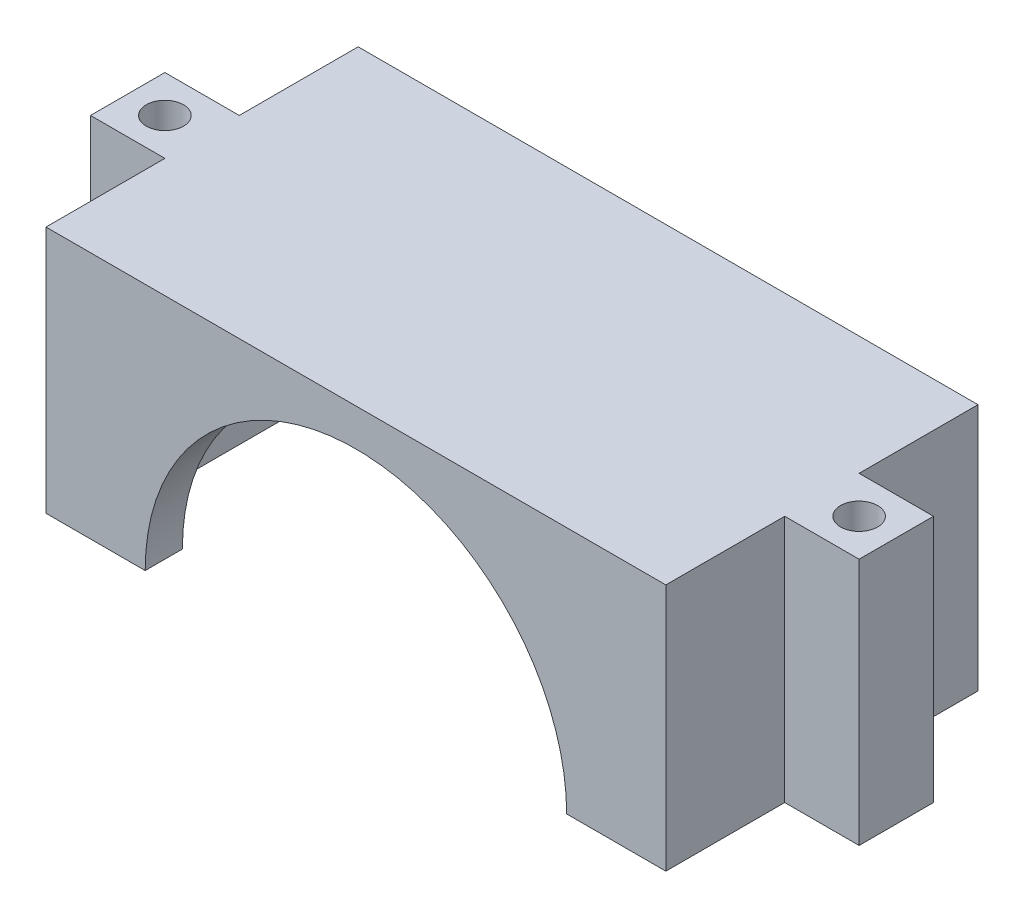
ISO-10303-21;
HEADER;
FILE_DESCRIPTION(('STEP AP214'),'2;1');
FILE_NAME('part.step','',(''),(''),'','','');
FILE_SCHEMA(('AUTOMOTIVE_DESIGN { 1 0 10303 214 1 1 1 1 }'));
ENDSEC;
DATA;
#1=APPLICATION_CONTEXT('core data for automotive mechanical design processes');
#2=APPLICATION_PROTOCOL_DEFINITION('international standard','automotive_design',2000,#1);
#3=PRODUCT_CONTEXT('',#1,'mechanical');
#4=PRODUCT('Part','Part','',(#3));
#5=PRODUCT_RELATED_PRODUCT_CATEGORY('part','',(#4));
#6=PRODUCT_DEFINITION_FORMATION('','',#4);
#7=PRODUCT_DEFINITION_CONTEXT('part definition',#1,'design');
#8=PRODUCT_DEFINITION('design','',#6,#7);
#9=PRODUCT_DEFINITION_SHAPE('','',#8);
#10=(LENGTH_UNIT() NAMED_UNIT(*) SI_UNIT(.MILLI.,.METRE.));
#11=(NAMED_UNIT(*) PLANE_ANGLE_UNIT() SI_UNIT($,.RADIAN.));
#12=(NAMED_UNIT(*) SI_UNIT($,.STERADIAN.) SOLID_ANGLE_UNIT());
#13=UNCERTAINTY_MEASURE_WITH_UNIT(LENGTH_MEASURE(1.E-05),#10,'distance_accuracy_value','');
#14=(GEOMETRIC_REPRESENTATION_CONTEXT(3) GLOBAL_UNCERTAINTY_ASSIGNED_CONTEXT((#13)) GLOBAL_UNIT_ASSIGNED_CONTEXT((#10,
#11,#12)) REPRESENTATION_CONTEXT('',''));
#15=CARTESIAN_POINT('',(0.,0.,0.));
#16=DIRECTION('',(0.,0.,1.));
#17=DIRECTION('',(1.,0.,0.));
#18=AXIS2_PLACEMENT_3D('',#15,#16,#17);
#19=CARTESIAN_POINT('',(-25.,20.,12.59));
#20=DIRECTION('',(1.,0.,0.));
#21=DIRECTION('',(0.,0.,-1.));
#22=AXIS2_PLACEMENT_3D('',#19,#20,#21);
#23=PLANE('',#22);
#24=DIRECTION('',(0.,1.,0.));
#25=VECTOR('',#24,1.);
#26=CARTESIAN_POINT('',(-25.,0.,3.00000000000001));
#27=LINE('',#26,#25);
#28=CARTESIAN_POINT('',(-25.,0.,3.00000000000001));
#29=VERTEX_POINT('',#28);
#30=CARTESIAN_POINT('',(-25.,20.,3.00000000000001));
#31=VERTEX_POINT('',#30);
#32=EDGE_CURVE('E185',#29,#31,#27,.T.);
#33=ORIENTED_EDGE('',*,*,#32,.F.);
#34=DIRECTION('',(0.,0.,1.));
#35=VECTOR('',#34,1.);
#36=CARTESIAN_POINT('',(-25.,0.,12.59));
#37=LINE('',#36,#35);
#38=CARTESIAN_POINT('',(-25.,0.,12.59));
#39=VERTEX_POINT('',#38);
#40=EDGE_CURVE('E198',#29,#39,#37,.T.);
#41=ORIENTED_EDGE('',*,*,#40,.T.);
#42=DIRECTION('',(0.,-1.,0.));
#43=VECTOR('',#42,1.);
#44=CARTESIAN_POINT('',(-25.,20.,12.59));
#45=LINE('',#44,#43);
#46=CARTESIAN_POINT('',(-25.,20.,12.59));
#47=VERTEX_POINT('',#46);
#48=EDGE_CURVE('E235',#47,#39,#45,.T.);
#49=ORIENTED_EDGE('',*,*,#48,.F.);
#50=DIRECTION('',(0.,0.,1.));
#51=VECTOR('',#50,1.);
#52=CARTESIAN_POINT('',(-25.,20.,12.59));
#53=LINE('',#52,#51);
#54=EDGE_CURVE('E200',#31,#47,#53,.T.);
#55=ORIENTED_EDGE('',*,*,#54,.F.);
#56=EDGE_LOOP('',(#33,#41,#49,#55));
#57=FACE_BOUND('',#56,.T.);
#58=ADVANCED_FACE('F35',(#57),#23,.F.);
#59=CARTESIAN_POINT('',(25.,20.,12.59));
#60=DIRECTION('',(-1.,0.,0.));
#61=DIRECTION('',(0.,0.,1.));
#62=AXIS2_PLACEMENT_3D('',#59,#60,#61);
#63=PLANE('',#62);
#64=DIRECTION('',(0.,1.,0.));
#65=VECTOR('',#64,1.);
#66=CARTESIAN_POINT('',(25.,0.,-3.));
#67=LINE('',#66,#65);
#68=CARTESIAN_POINT('',(25.,0.,-3.));
#69=VERTEX_POINT('',#68);
#70=CARTESIAN_POINT('',(25.,20.,-3.));
#71=VERTEX_POINT('',#70);
#72=EDGE_CURVE('E419',#69,#71,#67,.T.);
#73=ORIENTED_EDGE('',*,*,#72,.F.);
#74=DIRECTION('',(0.,0.,-1.));
#75=VECTOR('',#74,1.);
#76=CARTESIAN_POINT('',(25.,0.,12.59));
#77=LINE('',#76,#75);
#78=CARTESIAN_POINT('',(25.,0.,-12.59));
#79=VERTEX_POINT('',#78);
#80=EDGE_CURVE('E248',#69,#79,#77,.T.);
#81=ORIENTED_EDGE('',*,*,#80,.T.);
#82=DIRECTION('',(0.,-1.,0.));
#83=VECTOR('',#82,1.);
#84=CARTESIAN_POINT('',(25.,20.,-12.59));
#85=LINE('',#84,#83);
#86=CARTESIAN_POINT('',(25.,20.,-12.59));
#87=VERTEX_POINT('',#86);
#88=EDGE_CURVE('E241',#87,#79,#85,.T.);
#89=ORIENTED_EDGE('',*,*,#88,.F.);
#90=DIRECTION('',(0.,0.,-1.));
#91=VECTOR('',#90,1.);
#92=CARTESIAN_POINT('',(25.,20.,12.59));
#93=LINE('',#92,#91);
#94=EDGE_CURVE('E231',#71,#87,#93,.T.);
#95=ORIENTED_EDGE('',*,*,#94,.F.);
#96=EDGE_LOOP('',(#73,#81,#89,#95));
#97=FACE_BOUND('',#96,.T.);
#98=ADVANCED_FACE('F314',(#97),#63,.F.);
#99=CARTESIAN_POINT('',(-25.,20.,-12.59));
#100=DIRECTION('',(0.,0.,1.));
#101=DIRECTION('',(1.,0.,0.));
#102=AXIS2_PLACEMENT_3D('',#99,#100,#101);
#103=PLANE('',#102);
#104=DIRECTION('',(0.,-1.,0.));
#105=VECTOR('',#104,1.);
#106=CARTESIAN_POINT('',(12.,0.,-12.59));
#107=LINE('',#106,#105);
#108=CARTESIAN_POINT('',(12.,6.,-12.59));
#109=VERTEX_POINT('',#108);
#110=CARTESIAN_POINT('',(12.,0.,-12.59));
#111=VERTEX_POINT('',#110);
#112=EDGE_CURVE('E344',#109,#111,#107,.T.);
#113=ORIENTED_EDGE('',*,*,#112,.T.);
#114=DIRECTION('',(-1.,0.,0.));
#115=VECTOR('',#114,1.);
#116=CARTESIAN_POINT('',(-25.,0.,-12.59));
#117=LINE('',#116,#115);
#118=CARTESIAN_POINT('',(-25.,0.,-12.59));
#119=VERTEX_POINT('',#118);
#120=EDGE_CURVE('E218',#111,#119,#117,.T.);
#121=ORIENTED_EDGE('',*,*,#120,.T.);
#122=DIRECTION('',(0.,-1.,0.));
#123=VECTOR('',#122,1.);
#124=CARTESIAN_POINT('',(-25.,20.,-12.59));
#125=LINE('',#124,#123);
#126=CARTESIAN_POINT('',(-25.,20.,-12.59));
#127=VERTEX_POINT('',#126);
#128=EDGE_CURVE('E238',#127,#119,#125,.T.);
#129=ORIENTED_EDGE('',*,*,#128,.F.);
#130=DIRECTION('',(-1.,0.,0.));
#131=VECTOR('',#130,1.);
#132=CARTESIAN_POINT('',(-25.,20.,-12.59));
#133=LINE('',#132,#131);
#134=EDGE_CURVE('E255',#87,#127,#133,.T.);
#135=ORIENTED_EDGE('',*,*,#134,.F.);
#136=ORIENTED_EDGE('',*,*,#88,.T.);
#137=CARTESIAN_POINT('',(22.,0.,-12.59));
#138=VERTEX_POINT('',#137);
#139=EDGE_CURVE('E212',#79,#138,#117,.T.);
#140=ORIENTED_EDGE('',*,*,#139,.T.);
#141=DIRECTION('',(0.,-1.,0.));
#142=VECTOR('',#141,1.);
#143=CARTESIAN_POINT('',(22.,0.,-12.59));
#144=LINE('',#143,#142);
#145=CARTESIAN_POINT('',(22.,6.,-12.59));
#146=VERTEX_POINT('',#145);
#147=EDGE_CURVE('E351',#146,#138,#144,.T.);
#148=ORIENTED_EDGE('',*,*,#147,.F.);
#149=DIRECTION('',(-1.,0.,0.));
#150=VECTOR('',#149,1.);
#151=CARTESIAN_POINT('',(0.,6.,-12.59));
#152=LINE('',#151,#150);
#153=EDGE_CURVE('E347',#146,#109,#152,.T.);
#154=ORIENTED_EDGE('',*,*,#153,.T.);
#155=EDGE_LOOP('',(#113,#121,#129,#135,#136,#140,#148,#154));
#156=FACE_BOUND('',#155,.T.);
#157=ADVANCED_FACE('F320',(#156),#103,.F.);
#158=CARTESIAN_POINT('',(0.,0.,0.));
#159=DIRECTION('',(0.,-1.,0.));
#160=DIRECTION('',(0.,0.,-1.));
#161=AXIS2_PLACEMENT_3D('',#158,#159,#160);
#162=PLANE('',#161);
#163=ORIENTED_EDGE('',*,*,#120,.F.);
#164=DIRECTION('',(0.,0.,-1.));
#165=VECTOR('',#164,1.);
#166=CARTESIAN_POINT('',(12.,0.,4.41));
#167=LINE('',#166,#165);
#168=CARTESIAN_POINT('',(12.,0.,-9.59));
#169=VERTEX_POINT('',#168);
#170=EDGE_CURVE('E337',#169,#111,#167,.T.);
#171=ORIENTED_EDGE('',*,*,#170,.F.);
#172=DIRECTION('',(1.,0.,0.));
#173=VECTOR('',#172,1.);
#174=CARTESIAN_POINT('',(-22.,0.,-9.59));
#175=LINE('',#174,#173);
#176=CARTESIAN_POINT('',(-22.,0.,-9.59));
#177=VERTEX_POINT('',#176);
#178=EDGE_CURVE('E375',#177,#169,#175,.T.);
#179=ORIENTED_EDGE('',*,*,#178,.F.);
#180=DIRECTION('',(0.,0.,-1.));
#181=VECTOR('',#180,1.);
#182=CARTESIAN_POINT('',(-22.,0.,-9.59));
#183=LINE('',#182,#181);
#184=CARTESIAN_POINT('',(-22.,0.,9.59));
#185=VERTEX_POINT('',#184);
#186=EDGE_CURVE('E391',#185,#177,#183,.T.);
#187=ORIENTED_EDGE('',*,*,#186,.F.);
#188=DIRECTION('',(-1.,0.,0.));
#189=VECTOR('',#188,1.);
#190=CARTESIAN_POINT('',(-22.,0.,9.59));
#191=LINE('',#190,#189);
#192=CARTESIAN_POINT('',(-17.,0.,9.59));
#193=VERTEX_POINT('',#192);
#194=EDGE_CURVE('E387',#193,#185,#191,.T.);
#195=ORIENTED_EDGE('',*,*,#194,.F.);
#196=DIRECTION('',(0.,0.,1.));
#197=VECTOR('',#196,1.);
#198=CARTESIAN_POINT('',(-17.,0.,-28.4231556174964));
#199=LINE('',#198,#197);
#200=CARTESIAN_POINT('',(-17.,0.,12.59));
#201=VERTEX_POINT('',#200);
#202=EDGE_CURVE('E367',#193,#201,#199,.T.);
#203=ORIENTED_EDGE('',*,*,#202,.T.);
#204=DIRECTION('',(1.,0.,0.));
#205=VECTOR('',#204,1.);
#206=CARTESIAN_POINT('',(-25.,0.,12.59));
#207=LINE('',#206,#205);
#208=EDGE_CURVE('E210',#39,#201,#207,.T.);
#209=ORIENTED_EDGE('',*,*,#208,.F.);
#210=ORIENTED_EDGE('',*,*,#40,.F.);
#211=DIRECTION('',(1.,0.,0.));
#212=VECTOR('',#211,1.);
#213=CARTESIAN_POINT('',(-25.,0.,3.00000000000001));
#214=LINE('',#213,#212);
#215=CARTESIAN_POINT('',(-31.,0.,3.00000000000001));
#216=VERTEX_POINT('',#215);
#217=EDGE_CURVE('E181',#216,#29,#214,.T.);
#218=ORIENTED_EDGE('',*,*,#217,.F.);
#219=DIRECTION('',(0.,0.,1.));
#220=VECTOR('',#219,1.);
#221=CARTESIAN_POINT('',(-31.,0.,3.00000000000001));
#222=LINE('',#221,#220);
#223=CARTESIAN_POINT('',(-31.,0.,-2.99999999999999));
#224=VERTEX_POINT('',#223);
#225=EDGE_CURVE('E202',#224,#216,#222,.T.);
#226=ORIENTED_EDGE('',*,*,#225,.F.);
#227=DIRECTION('',(-1.,0.,0.));
#228=VECTOR('',#227,1.);
#229=CARTESIAN_POINT('',(-25.,0.,-2.99999999999999));
#230=LINE('',#229,#228);
#231=CARTESIAN_POINT('',(-25.,0.,-2.99999999999999));
#232=VERTEX_POINT('',#231);
#233=EDGE_CURVE('E192',#232,#224,#230,.T.);
#234=ORIENTED_EDGE('',*,*,#233,.F.);
#235=EDGE_CURVE('E211',#119,#232,#37,.T.);
#236=ORIENTED_EDGE('',*,*,#235,.F.);
#237=EDGE_LOOP('',(#163,#171,#179,#187,#195,#203,#209,#210,#218,#226,#234,#236));
#238=FACE_BOUND('',#237,.T.);
#239=CARTESIAN_POINT('',(-28.,0.,0.));
#240=DIRECTION('',(0.,1.,0.));
#241=DIRECTION('',(0.,0.,-1.));
#242=AXIS2_PLACEMENT_3D('',#239,#240,#241);
#243=CIRCLE('',#242,1.5);
#244=CARTESIAN_POINT('',(-28.,0.,-1.5));
#245=VERTEX_POINT('',#244);
#246=EDGE_CURVE('E278',#245,#245,#243,.T.);
#247=ORIENTED_EDGE('',*,*,#246,.T.);
#248=EDGE_LOOP('',(#247));
#249=FACE_BOUND('',#248,.T.);
#250=ADVANCED_FACE('F206',(#238,#249),#162,.T.);
#251=CARTESIAN_POINT('',(-22.,17.,-9.59));
#252=DIRECTION('',(0.,0.,-1.));
#253=DIRECTION('',(-1.,0.,0.));
#254=AXIS2_PLACEMENT_3D('',#251,#252,#253);
#255=PLANE('',#254);
#256=DIRECTION('',(-1.,0.,0.));
#257=VECTOR('',#256,1.);
#258=CARTESIAN_POINT('',(-22.,6.,-9.59));
#259=LINE('',#258,#257);
#260=CARTESIAN_POINT('',(22.,6.,-9.59));
#261=VERTEX_POINT('',#260);
#262=CARTESIAN_POINT('',(12.,6.,-9.59));
#263=VERTEX_POINT('',#262);
#264=EDGE_CURVE('E11',#261,#263,#259,.T.);
#265=ORIENTED_EDGE('',*,*,#264,.F.);
#266=DIRECTION('',(0.,-1.,0.));
#267=VECTOR('',#266,1.);
#268=CARTESIAN_POINT('',(22.,17.,-9.59));
#269=LINE('',#268,#267);
#270=CARTESIAN_POINT('',(22.,17.,-9.59));
#271=VERTEX_POINT('',#270);
#272=EDGE_CURVE('E395',#271,#261,#269,.T.);
#273=ORIENTED_EDGE('',*,*,#272,.F.);
#274=DIRECTION('',(1.,0.,0.));
#275=VECTOR('',#274,1.);
#276=CARTESIAN_POINT('',(-22.,17.,-9.59));
#277=LINE('',#276,#275);
#278=CARTESIAN_POINT('',(-22.,17.,-9.59));
#279=VERTEX_POINT('',#278);
#280=EDGE_CURVE('E382',#279,#271,#277,.T.);
#281=ORIENTED_EDGE('',*,*,#280,.F.);
#282=DIRECTION('',(0.,-1.,0.));
#283=VECTOR('',#282,1.);
#284=CARTESIAN_POINT('',(-22.,17.,-9.59));
#285=LINE('',#284,#283);
#286=EDGE_CURVE('E398',#279,#177,#285,.T.);
#287=ORIENTED_EDGE('',*,*,#286,.T.);
#288=ORIENTED_EDGE('',*,*,#178,.T.);
#289=DIRECTION('',(0.,-1.,0.));
#290=VECTOR('',#289,1.);
#291=CARTESIAN_POINT('',(12.,17.,-9.59));
#292=LINE('',#291,#290);
#293=EDGE_CURVE('E44',#263,#169,#292,.T.);
#294=ORIENTED_EDGE('',*,*,#293,.F.);
#295=EDGE_LOOP('',(#265,#273,#281,#287,#288,#294));
#296=FACE_BOUND('',#295,.T.);
#297=ADVANCED_FACE('F565',(#296),#255,.F.);
#298=CARTESIAN_POINT('',(-22.,17.,9.59));
#299=DIRECTION('',(0.,0.,1.));
#300=DIRECTION('',(1.,0.,0.));
#301=AXIS2_PLACEMENT_3D('',#298,#299,#300);
#302=PLANE('',#301);
#303=CARTESIAN_POINT('',(22.,0.,9.59));
#304=VERTEX_POINT('',#303);
#305=CARTESIAN_POINT('',(17.,0.,9.58999999999998));
#306=VERTEX_POINT('',#305);
#307=EDGE_CURVE('E388',#304,#306,#191,.T.);
#308=ORIENTED_EDGE('',*,*,#307,.T.);
#309=CARTESIAN_POINT('',(0.,0.,9.59));
#310=DIRECTION('',(0.,0.,1.));
#311=DIRECTION('',(1.,0.,0.));
#312=AXIS2_PLACEMENT_3D('',#309,#310,#311);
#313=CIRCLE('',#312,17.);
#314=CARTESIAN_POINT('',(0.,17.,9.59));
#315=VERTEX_POINT('',#314);
#316=EDGE_CURVE('E365',#315,#306,#313,.F.);
#317=ORIENTED_EDGE('',*,*,#316,.F.);
#318=DIRECTION('',(-1.,0.,0.));
#319=VECTOR('',#318,1.);
#320=CARTESIAN_POINT('',(-22.,17.,9.59));
#321=LINE('',#320,#319);
#322=CARTESIAN_POINT('',(22.,17.,9.59));
#323=VERTEX_POINT('',#322);
#324=EDGE_CURVE('E376',#323,#315,#321,.T.);
#325=ORIENTED_EDGE('',*,*,#324,.F.);
#326=DIRECTION('',(0.,-1.,0.));
#327=VECTOR('',#326,1.);
#328=CARTESIAN_POINT('',(22.,17.,9.59));
#329=LINE('',#328,#327);
#330=EDGE_CURVE('E385',#323,#304,#329,.T.);
#331=ORIENTED_EDGE('',*,*,#330,.T.);
#332=EDGE_LOOP('',(#308,#317,#325,#331));
#333=FACE_BOUND('',#332,.T.);
#334=ADVANCED_FACE('F331',(#333),#302,.F.);
#335=CARTESIAN_POINT('',(25.,0.,12.59));
#336=VERTEX_POINT('',#335);
#337=CARTESIAN_POINT('',(25.,0.,3.));
#338=VERTEX_POINT('',#337);
#339=EDGE_CURVE('E245',#336,#338,#77,.T.);
#340=ORIENTED_EDGE('',*,*,#339,.T.);
#341=DIRECTION('',(0.,1.,0.));
#342=VECTOR('',#341,1.);
#343=CARTESIAN_POINT('',(25.,0.,3.));
#344=LINE('',#343,#342);
#345=CARTESIAN_POINT('',(25.,20.,3.));
#346=VERTEX_POINT('',#345);
#347=EDGE_CURVE('E439',#338,#346,#344,.T.);
#348=ORIENTED_EDGE('',*,*,#347,.T.);
#349=CARTESIAN_POINT('',(25.,20.,12.59));
#350=VERTEX_POINT('',#349);
#351=EDGE_CURVE('E408',#350,#346,#93,.T.);
#352=ORIENTED_EDGE('',*,*,#351,.F.);
#353=DIRECTION('',(0.,-1.,0.));
#354=VECTOR('',#353,1.);
#355=CARTESIAN_POINT('',(25.,20.,12.59));
#356=LINE('',#355,#354);
#357=EDGE_CURVE('E232',#350,#336,#356,.T.);
#358=ORIENTED_EDGE('',*,*,#357,.T.);
#359=EDGE_LOOP('',(#340,#348,#352,#358));
#360=FACE_BOUND('',#359,.T.);
#361=ADVANCED_FACE('F37',(#360),#63,.F.);
#362=ORIENTED_EDGE('',*,*,#235,.T.);
#363=DIRECTION('',(0.,1.,0.));
#364=VECTOR('',#363,1.);
#365=CARTESIAN_POINT('',(-25.,0.,-2.99999999999999));
#366=LINE('',#365,#364);
#367=CARTESIAN_POINT('',(-25.,20.,-2.99999999999999));
#368=VERTEX_POINT('',#367);
#369=EDGE_CURVE('E201',#232,#368,#366,.T.);
#370=ORIENTED_EDGE('',*,*,#369,.T.);
#371=EDGE_CURVE('E223',#127,#368,#53,.T.);
#372=ORIENTED_EDGE('',*,*,#371,.F.);
#373=ORIENTED_EDGE('',*,*,#128,.T.);
#374=EDGE_LOOP('',(#362,#370,#372,#373));
#375=FACE_BOUND('',#374,.T.);
#376=ADVANCED_FACE('F316',(#375),#23,.F.);
#377=CARTESIAN_POINT('',(-25.,20.,12.59));
#378=DIRECTION('',(0.,0.,-1.));
#379=DIRECTION('',(-1.,0.,0.));
#380=AXIS2_PLACEMENT_3D('',#377,#378,#379);
#381=PLANE('',#380);
#382=ORIENTED_EDGE('',*,*,#208,.T.);
#383=CARTESIAN_POINT('',(0.,0.,12.59));
#384=DIRECTION('',(0.,0.,1.));
#385=DIRECTION('',(1.,0.,0.));
#386=AXIS2_PLACEMENT_3D('',#383,#384,#385);
#387=CIRCLE('',#386,17.);
#388=CARTESIAN_POINT('',(17.,0.,12.59));
#389=VERTEX_POINT('',#388);
#390=EDGE_CURVE('E360',#389,#201,#387,.T.);
#391=ORIENTED_EDGE('',*,*,#390,.F.);
#392=EDGE_CURVE('E215',#389,#336,#207,.T.);
#393=ORIENTED_EDGE('',*,*,#392,.T.);
#394=ORIENTED_EDGE('',*,*,#357,.F.);
#395=DIRECTION('',(1.,0.,0.));
#396=VECTOR('',#395,1.);
#397=CARTESIAN_POINT('',(-25.,20.,12.59));
#398=LINE('',#397,#396);
#399=EDGE_CURVE('E236',#47,#350,#398,.T.);
#400=ORIENTED_EDGE('',*,*,#399,.F.);
#401=ORIENTED_EDGE('',*,*,#48,.T.);
#402=EDGE_LOOP('',(#382,#391,#393,#394,#400,#401));
#403=FACE_BOUND('',#402,.T.);
#404=ADVANCED_FACE('F324',(#403),#381,.F.);
#405=CARTESIAN_POINT('',(0.,20.,0.));
#406=DIRECTION('',(0.,-1.,0.));
#407=DIRECTION('',(0.,0.,-1.));
#408=AXIS2_PLACEMENT_3D('',#405,#406,#407);
#409=PLANE('',#408);
#410=ORIENTED_EDGE('',*,*,#351,.T.);
#411=DIRECTION('',(1.,0.,0.));
#412=VECTOR('',#411,1.);
#413=CARTESIAN_POINT('',(25.,20.,3.));
#414=LINE('',#413,#412);
#415=CARTESIAN_POINT('',(31.,20.,3.));
#416=VERTEX_POINT('',#415);
#417=EDGE_CURVE('E60',#346,#416,#414,.T.);
#418=ORIENTED_EDGE('',*,*,#417,.T.);
#419=DIRECTION('',(0.,0.,-1.));
#420=VECTOR('',#419,1.);
#421=CARTESIAN_POINT('',(31.,20.,3.));
#422=LINE('',#421,#420);
#423=CARTESIAN_POINT('',(31.,20.,-3.));
#424=VERTEX_POINT('',#423);
#425=EDGE_CURVE('E454',#416,#424,#422,.T.);
#426=ORIENTED_EDGE('',*,*,#425,.T.);
#427=DIRECTION('',(-1.,0.,0.));
#428=VECTOR('',#427,1.);
#429=CARTESIAN_POINT('',(25.,20.,-3.));
#430=LINE('',#429,#428);
#431=EDGE_CURVE('E414',#424,#71,#430,.T.);
#432=ORIENTED_EDGE('',*,*,#431,.T.);
#433=ORIENTED_EDGE('',*,*,#94,.T.);
#434=ORIENTED_EDGE('',*,*,#134,.T.);
#435=ORIENTED_EDGE('',*,*,#371,.T.);
#436=DIRECTION('',(-1.,0.,0.));
#437=VECTOR('',#436,1.);
#438=CARTESIAN_POINT('',(-25.,20.,-2.99999999999999));
#439=LINE('',#438,#437);
#440=CARTESIAN_POINT('',(-31.,20.,-2.99999999999999));
#441=VERTEX_POINT('',#440);
#442=EDGE_CURVE('E52',#368,#441,#439,.T.);
#443=ORIENTED_EDGE('',*,*,#442,.T.);
#444=DIRECTION('',(0.,0.,1.));
#445=VECTOR('',#444,1.);
#446=CARTESIAN_POINT('',(-31.,20.,3.00000000000001));
#447=LINE('',#446,#445);
#448=CARTESIAN_POINT('',(-31.,20.,3.00000000000001));
#449=VERTEX_POINT('',#448);
#450=EDGE_CURVE('E193',#441,#449,#447,.T.);
#451=ORIENTED_EDGE('',*,*,#450,.T.);
#452=DIRECTION('',(1.,0.,0.));
#453=VECTOR('',#452,1.);
#454=CARTESIAN_POINT('',(-25.,20.,3.00000000000001));
#455=LINE('',#454,#453);
#456=EDGE_CURVE('E260',#449,#31,#455,.T.);
#457=ORIENTED_EDGE('',*,*,#456,.T.);
#458=ORIENTED_EDGE('',*,*,#54,.T.);
#459=ORIENTED_EDGE('',*,*,#399,.T.);
#460=EDGE_LOOP('',(#410,#418,#426,#432,#433,#434,#435,#443,#451,#457,#458,#459));
#461=FACE_BOUND('',#460,.T.);
#462=CARTESIAN_POINT('',(28.,20.,0.));
#463=DIRECTION('',(0.,1.,0.));
#464=DIRECTION('',(0.,0.,1.));
#465=AXIS2_PLACEMENT_3D('',#462,#463,#464);
#466=CIRCLE('',#465,1.5);
#467=CARTESIAN_POINT('',(28.,20.,1.5));
#468=VERTEX_POINT('',#467);
#469=EDGE_CURVE('E289',#468,#468,#466,.T.);
#470=ORIENTED_EDGE('',*,*,#469,.F.);
#471=EDGE_LOOP('',(#470));
#472=FACE_BOUND('',#471,.T.);
#473=CARTESIAN_POINT('',(-28.,20.,0.));
#474=DIRECTION('',(0.,1.,0.));
#475=DIRECTION('',(0.,0.,-1.));
#476=AXIS2_PLACEMENT_3D('',#473,#474,#475);
#477=CIRCLE('',#476,1.5);
#478=CARTESIAN_POINT('',(-28.,20.,-1.5));
#479=VERTEX_POINT('',#478);
#480=EDGE_CURVE('E282',#479,#479,#477,.T.);
#481=ORIENTED_EDGE('',*,*,#480,.F.);
#482=EDGE_LOOP('',(#481));
#483=FACE_BOUND('',#482,.T.);
#484=ADVANCED_FACE('F298',(#461,#472,#483),#409,.F.);
#485=DIRECTION('',(0.,0.,1.));
#486=VECTOR('',#485,1.);
#487=CARTESIAN_POINT('',(22.,0.,-9.59));
#488=LINE('',#487,#486);
#489=EDGE_CURVE('E364',#138,#304,#488,.T.);
#490=ORIENTED_EDGE('',*,*,#489,.F.);
#491=ORIENTED_EDGE('',*,*,#139,.F.);
#492=ORIENTED_EDGE('',*,*,#80,.F.);
#493=DIRECTION('',(-1.,0.,0.));
#494=VECTOR('',#493,1.);
#495=CARTESIAN_POINT('',(25.,0.,-3.));
#496=LINE('',#495,#494);
#497=CARTESIAN_POINT('',(31.,0.,-3.));
#498=VERTEX_POINT('',#497);
#499=EDGE_CURVE('E442',#498,#69,#496,.T.);
#500=ORIENTED_EDGE('',*,*,#499,.F.);
#501=DIRECTION('',(0.,0.,-1.));
#502=VECTOR('',#501,1.);
#503=CARTESIAN_POINT('',(31.,0.,3.));
#504=LINE('',#503,#502);
#505=CARTESIAN_POINT('',(31.,0.,3.));
#506=VERTEX_POINT('',#505);
#507=EDGE_CURVE('E447',#506,#498,#504,.T.);
#508=ORIENTED_EDGE('',*,*,#507,.F.);
#509=DIRECTION('',(1.,0.,0.));
#510=VECTOR('',#509,1.);
#511=CARTESIAN_POINT('',(25.,0.,3.));
#512=LINE('',#511,#510);
#513=EDGE_CURVE('E444',#338,#506,#512,.T.);
#514=ORIENTED_EDGE('',*,*,#513,.F.);
#515=ORIENTED_EDGE('',*,*,#339,.F.);
#516=ORIENTED_EDGE('',*,*,#392,.F.);
#517=DIRECTION('',(0.,0.,1.));
#518=VECTOR('',#517,1.);
#519=CARTESIAN_POINT('',(17.,0.,-28.4231556174964));
#520=LINE('',#519,#518);
#521=EDGE_CURVE('E368',#306,#389,#520,.T.);
#522=ORIENTED_EDGE('',*,*,#521,.F.);
#523=ORIENTED_EDGE('',*,*,#307,.F.);
#524=EDGE_LOOP('',(#490,#491,#492,#500,#508,#514,#515,#516,#522,#523));
#525=FACE_BOUND('',#524,.T.);
#526=CARTESIAN_POINT('',(28.,0.,0.));
#527=DIRECTION('',(0.,1.,0.));
#528=DIRECTION('',(0.,0.,1.));
#529=AXIS2_PLACEMENT_3D('',#526,#527,#528);
#530=CIRCLE('',#529,1.5);
#531=CARTESIAN_POINT('',(28.,0.,1.5));
#532=VERTEX_POINT('',#531);
#533=EDGE_CURVE('E273',#532,#532,#530,.T.);
#534=ORIENTED_EDGE('',*,*,#533,.T.);
#535=EDGE_LOOP('',(#534));
#536=FACE_BOUND('',#535,.T.);
#537=ADVANCED_FACE('F422',(#525,#536),#162,.T.);
#538=CARTESIAN_POINT('',(22.,17.,-9.59));
#539=DIRECTION('',(1.,0.,0.));
#540=DIRECTION('',(0.,0.,-1.));
#541=AXIS2_PLACEMENT_3D('',#538,#539,#540);
#542=PLANE('',#541);
#543=ORIENTED_EDGE('',*,*,#272,.T.);
#544=DIRECTION('',(0.,0.,-1.));
#545=VECTOR('',#544,1.);
#546=CARTESIAN_POINT('',(22.,6.,4.41));
#547=LINE('',#546,#545);
#548=EDGE_CURVE('E350',#261,#146,#547,.T.);
#549=ORIENTED_EDGE('',*,*,#548,.T.);
#550=ORIENTED_EDGE('',*,*,#147,.T.);
#551=ORIENTED_EDGE('',*,*,#489,.T.);
#552=ORIENTED_EDGE('',*,*,#330,.F.);
#553=DIRECTION('',(0.,0.,1.));
#554=VECTOR('',#553,1.);
#555=CARTESIAN_POINT('',(22.,17.,-9.59));
#556=LINE('',#555,#554);
#557=EDGE_CURVE('E371',#271,#323,#556,.T.);
#558=ORIENTED_EDGE('',*,*,#557,.F.);
#559=EDGE_LOOP('',(#543,#549,#550,#551,#552,#558));
#560=FACE_BOUND('',#559,.T.);
#561=ADVANCED_FACE('F426',(#560),#542,.F.);
#562=CARTESIAN_POINT('',(-22.,17.,-9.59));
#563=DIRECTION('',(-1.,0.,0.));
#564=DIRECTION('',(0.,0.,1.));
#565=AXIS2_PLACEMENT_3D('',#562,#563,#564);
#566=PLANE('',#565);
#567=ORIENTED_EDGE('',*,*,#186,.T.);
#568=ORIENTED_EDGE('',*,*,#286,.F.);
#569=DIRECTION('',(0.,0.,-1.));
#570=VECTOR('',#569,1.);
#571=CARTESIAN_POINT('',(-22.,17.,-9.59));
#572=LINE('',#571,#570);
#573=CARTESIAN_POINT('',(-22.,17.,9.59));
#574=VERTEX_POINT('',#573);
#575=EDGE_CURVE('E379',#574,#279,#572,.T.);
#576=ORIENTED_EDGE('',*,*,#575,.F.);
#577=DIRECTION('',(0.,-1.,0.));
#578=VECTOR('',#577,1.);
#579=CARTESIAN_POINT('',(-22.,17.,9.59));
#580=LINE('',#579,#578);
#581=EDGE_CURVE('E400',#574,#185,#580,.T.);
#582=ORIENTED_EDGE('',*,*,#581,.T.);
#583=EDGE_LOOP('',(#567,#568,#576,#582));
#584=FACE_BOUND('',#583,.T.);
#585=ADVANCED_FACE('F602',(#584),#566,.F.);
#586=EDGE_CURVE('E374',#315,#574,#321,.T.);
#587=ORIENTED_EDGE('',*,*,#586,.F.);
#588=EDGE_CURVE('E362',#193,#315,#313,.F.);
#589=ORIENTED_EDGE('',*,*,#588,.F.);
#590=ORIENTED_EDGE('',*,*,#194,.T.);
#591=ORIENTED_EDGE('',*,*,#581,.F.);
#592=EDGE_LOOP('',(#587,#589,#590,#591));
#593=FACE_BOUND('',#592,.T.);
#594=ADVANCED_FACE('F637',(#593),#302,.F.);
#595=CARTESIAN_POINT('',(0.,17.,0.));
#596=DIRECTION('',(0.,1.,0.));
#597=DIRECTION('',(0.,0.,1.));
#598=AXIS2_PLACEMENT_3D('',#595,#596,#597);
#599=PLANE('',#598);
#600=ORIENTED_EDGE('',*,*,#557,.T.);
#601=ORIENTED_EDGE('',*,*,#324,.T.);
#602=ORIENTED_EDGE('',*,*,#586,.T.);
#603=ORIENTED_EDGE('',*,*,#575,.T.);
#604=ORIENTED_EDGE('',*,*,#280,.T.);
#605=EDGE_LOOP('',(#600,#601,#602,#603,#604));
#606=FACE_BOUND('',#605,.T.);
#607=ADVANCED_FACE('F626',(#606),#599,.F.);
#608=CARTESIAN_POINT('',(0.,0.,-28.4231556174964));
#609=DIRECTION('',(0.,0.,1.));
#610=DIRECTION('',(1.,0.,0.));
#611=AXIS2_PLACEMENT_3D('',#608,#609,#610);
#612=CYLINDRICAL_SURFACE('',#611,17.);
#613=ORIENTED_EDGE('',*,*,#588,.T.);
#614=ORIENTED_EDGE('',*,*,#316,.T.);
#615=ORIENTED_EDGE('',*,*,#521,.T.);
#616=ORIENTED_EDGE('',*,*,#390,.T.);
#617=ORIENTED_EDGE('',*,*,#202,.F.);
#618=EDGE_LOOP('',(#613,#614,#615,#616,#617));
#619=FACE_BOUND('',#618,.T.);
#620=ADVANCED_FACE('F593',(#619),#612,.F.);
#621=CARTESIAN_POINT('',(0.,6.,4.41));
#622=DIRECTION('',(0.,-1.,0.));
#623=DIRECTION('',(0.,0.,-1.));
#624=AXIS2_PLACEMENT_3D('',#621,#622,#623);
#625=PLANE('',#624);
#626=ORIENTED_EDGE('',*,*,#264,.T.);
#627=DIRECTION('',(0.,0.,-1.));
#628=VECTOR('',#627,1.);
#629=CARTESIAN_POINT('',(12.,6.,4.41));
#630=LINE('',#629,#628);
#631=EDGE_CURVE('E358',#263,#109,#630,.T.);
#632=ORIENTED_EDGE('',*,*,#631,.T.);
#633=ORIENTED_EDGE('',*,*,#153,.F.);
#634=ORIENTED_EDGE('',*,*,#548,.F.);
#635=EDGE_LOOP('',(#626,#632,#633,#634));
#636=FACE_BOUND('',#635,.T.);
#637=ADVANCED_FACE('F430',(#636),#625,.T.);
#638=CARTESIAN_POINT('',(12.,0.,4.41));
#639=DIRECTION('',(1.,0.,0.));
#640=DIRECTION('',(0.,0.,-1.));
#641=AXIS2_PLACEMENT_3D('',#638,#639,#640);
#642=PLANE('',#641);
#643=ORIENTED_EDGE('',*,*,#293,.T.);
#644=ORIENTED_EDGE('',*,*,#170,.T.);
#645=ORIENTED_EDGE('',*,*,#112,.F.);
#646=ORIENTED_EDGE('',*,*,#631,.F.);
#647=EDGE_LOOP('',(#643,#644,#645,#646));
#648=FACE_BOUND('',#647,.T.);
#649=ADVANCED_FACE('F525',(#648),#642,.T.);
#650=CARTESIAN_POINT('',(25.,0.,-3.));
#651=DIRECTION('',(0.,0.,-1.));
#652=DIRECTION('',(-1.,0.,0.));
#653=AXIS2_PLACEMENT_3D('',#650,#651,#652);
#654=PLANE('',#653);
#655=ORIENTED_EDGE('',*,*,#431,.F.);
#656=DIRECTION('',(0.,1.,0.));
#657=VECTOR('',#656,1.);
#658=CARTESIAN_POINT('',(31.,0.,-3.));
#659=LINE('',#658,#657);
#660=EDGE_CURVE('E431',#498,#424,#659,.T.);
#661=ORIENTED_EDGE('',*,*,#660,.F.);
#662=ORIENTED_EDGE('',*,*,#499,.T.);
#663=ORIENTED_EDGE('',*,*,#72,.T.);
#664=EDGE_LOOP('',(#655,#661,#662,#663));
#665=FACE_BOUND('',#664,.T.);
#666=ADVANCED_FACE('F516',(#665),#654,.T.);
#667=CARTESIAN_POINT('',(31.,0.,3.));
#668=DIRECTION('',(1.,0.,0.));
#669=DIRECTION('',(0.,0.,-1.));
#670=AXIS2_PLACEMENT_3D('',#667,#668,#669);
#671=PLANE('',#670);
#672=ORIENTED_EDGE('',*,*,#425,.F.);
#673=DIRECTION('',(0.,1.,0.));
#674=VECTOR('',#673,1.);
#675=CARTESIAN_POINT('',(31.,0.,3.));
#676=LINE('',#675,#674);
#677=EDGE_CURVE('E436',#506,#416,#676,.T.);
#678=ORIENTED_EDGE('',*,*,#677,.F.);
#679=ORIENTED_EDGE('',*,*,#507,.T.);
#680=ORIENTED_EDGE('',*,*,#660,.T.);
#681=EDGE_LOOP('',(#672,#678,#679,#680));
#682=FACE_BOUND('',#681,.T.);
#683=ADVANCED_FACE('F462',(#682),#671,.T.);
#684=CARTESIAN_POINT('',(25.,0.,3.));
#685=DIRECTION('',(0.,0.,1.));
#686=DIRECTION('',(1.,0.,0.));
#687=AXIS2_PLACEMENT_3D('',#684,#685,#686);
#688=PLANE('',#687);
#689=ORIENTED_EDGE('',*,*,#417,.F.);
#690=ORIENTED_EDGE('',*,*,#347,.F.);
#691=ORIENTED_EDGE('',*,*,#513,.T.);
#692=ORIENTED_EDGE('',*,*,#677,.T.);
#693=EDGE_LOOP('',(#689,#690,#691,#692));
#694=FACE_BOUND('',#693,.T.);
#695=ADVANCED_FACE('F459',(#694),#688,.T.);
#696=CARTESIAN_POINT('',(28.,0.,0.));
#697=DIRECTION('',(0.,1.,0.));
#698=DIRECTION('',(0.,0.,1.));
#699=AXIS2_PLACEMENT_3D('',#696,#697,#698);
#700=CYLINDRICAL_SURFACE('',#699,1.5);
#701=ORIENTED_EDGE('',*,*,#533,.F.);
#702=EDGE_LOOP('',(#701));
#703=FACE_BOUND('',#702,.T.);
#704=ORIENTED_EDGE('',*,*,#469,.T.);
#705=EDGE_LOOP('',(#704));
#706=FACE_BOUND('',#705,.T.);
#707=ADVANCED_FACE('F310',(#703,#706),#700,.F.);
#708=CARTESIAN_POINT('',(-25.,0.,3.00000000000001));
#709=DIRECTION('',(0.,0.,1.));
#710=DIRECTION('',(1.,0.,0.));
#711=AXIS2_PLACEMENT_3D('',#708,#709,#710);
#712=PLANE('',#711);
#713=ORIENTED_EDGE('',*,*,#456,.F.);
#714=DIRECTION('',(0.,1.,0.));
#715=VECTOR('',#714,1.);
#716=CARTESIAN_POINT('',(-31.,0.,3.00000000000001));
#717=LINE('',#716,#715);
#718=EDGE_CURVE('E187',#216,#449,#717,.T.);
#719=ORIENTED_EDGE('',*,*,#718,.F.);
#720=ORIENTED_EDGE('',*,*,#217,.T.);
#721=ORIENTED_EDGE('',*,*,#32,.T.);
#722=EDGE_LOOP('',(#713,#719,#720,#721));
#723=FACE_BOUND('',#722,.T.);
#724=ADVANCED_FACE('F184',(#723),#712,.T.);
#725=CARTESIAN_POINT('',(-31.,0.,3.00000000000001));
#726=DIRECTION('',(-1.,0.,0.));
#727=DIRECTION('',(0.,0.,1.));
#728=AXIS2_PLACEMENT_3D('',#725,#726,#727);
#729=PLANE('',#728);
#730=ORIENTED_EDGE('',*,*,#450,.F.);
#731=DIRECTION('',(0.,1.,0.));
#732=VECTOR('',#731,1.);
#733=CARTESIAN_POINT('',(-31.,0.,-2.99999999999999));
#734=LINE('',#733,#732);
#735=EDGE_CURVE('E265',#224,#441,#734,.T.);
#736=ORIENTED_EDGE('',*,*,#735,.F.);
#737=ORIENTED_EDGE('',*,*,#225,.T.);
#738=ORIENTED_EDGE('',*,*,#718,.T.);
#739=EDGE_LOOP('',(#730,#736,#737,#738));
#740=FACE_BOUND('',#739,.T.);
#741=ADVANCED_FACE('F301',(#740),#729,.T.);
#742=CARTESIAN_POINT('',(-25.,0.,-2.99999999999999));
#743=DIRECTION('',(0.,0.,-1.));
#744=DIRECTION('',(-1.,0.,0.));
#745=AXIS2_PLACEMENT_3D('',#742,#743,#744);
#746=PLANE('',#745);
#747=ORIENTED_EDGE('',*,*,#442,.F.);
#748=ORIENTED_EDGE('',*,*,#369,.F.);
#749=ORIENTED_EDGE('',*,*,#233,.T.);
#750=ORIENTED_EDGE('',*,*,#735,.T.);
#751=EDGE_LOOP('',(#747,#748,#749,#750));
#752=FACE_BOUND('',#751,.T.);
#753=ADVANCED_FACE('F294',(#752),#746,.T.);
#754=CARTESIAN_POINT('',(-28.,0.,0.));
#755=DIRECTION('',(0.,1.,0.));
#756=DIRECTION('',(0.,0.,1.));
#757=AXIS2_PLACEMENT_3D('',#754,#755,#756);
#758=CYLINDRICAL_SURFACE('',#757,1.5);
#759=ORIENTED_EDGE('',*,*,#246,.F.);
#760=EDGE_LOOP('',(#759));
#761=FACE_BOUND('',#760,.T.);
#762=ORIENTED_EDGE('',*,*,#480,.T.);
#763=EDGE_LOOP('',(#762));
#764=FACE_BOUND('',#763,.T.);
#765=ADVANCED_FACE('F308',(#761,#764),#758,.F.);
#766=CLOSED_SHELL('',(#58,#98,#157,#250,#297,#334,#361,#376,#404,#484,#537,#561,#585,#594,#607,
#620,#637,#649,#666,#683,#695,#707,#724,#741,#753,#765));
#767=MANIFOLD_SOLID_BREP('B2',#766);
#768=ADVANCED_BREP_SHAPE_REPRESENTATION('',(#18,#767),#14);
#769=SHAPE_DEFINITION_REPRESENTATION(#9,#768);
ENDSEC;
END-ISO-10303-21;
